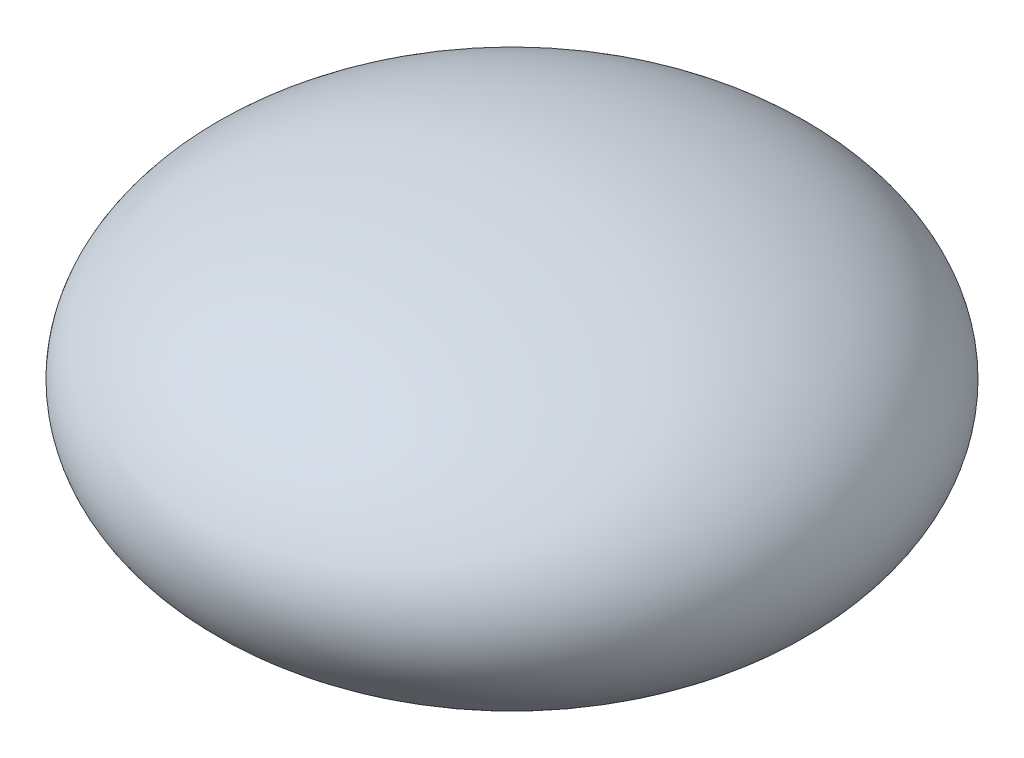
ISO-10303-21;
HEADER;
FILE_DESCRIPTION(('STEP AP214'),'2;1');
FILE_NAME('part.step','',(''),(''),'','','');
FILE_SCHEMA(('AUTOMOTIVE_DESIGN { 1 0 10303 214 1 1 1 1 }'));
ENDSEC;
DATA;
#1=APPLICATION_CONTEXT('core data for automotive mechanical design processes');
#2=APPLICATION_PROTOCOL_DEFINITION('international standard','automotive_design',2000,#1);
#3=PRODUCT_CONTEXT('',#1,'mechanical');
#4=PRODUCT('Part','Part','',(#3));
#5=PRODUCT_RELATED_PRODUCT_CATEGORY('part','',(#4));
#6=PRODUCT_DEFINITION_FORMATION('','',#4);
#7=PRODUCT_DEFINITION_CONTEXT('part definition',#1,'design');
#8=PRODUCT_DEFINITION('design','',#6,#7);
#9=PRODUCT_DEFINITION_SHAPE('','',#8);
#10=(LENGTH_UNIT() NAMED_UNIT(*) SI_UNIT(.MILLI.,.METRE.));
#11=(NAMED_UNIT(*) PLANE_ANGLE_UNIT() SI_UNIT($,.RADIAN.));
#12=(NAMED_UNIT(*) SI_UNIT($,.STERADIAN.) SOLID_ANGLE_UNIT());
#13=UNCERTAINTY_MEASURE_WITH_UNIT(LENGTH_MEASURE(1.E-05),#10,'distance_accuracy_value','');
#14=(GEOMETRIC_REPRESENTATION_CONTEXT(3) GLOBAL_UNCERTAINTY_ASSIGNED_CONTEXT((#13)) GLOBAL_UNIT_ASSIGNED_CONTEXT((#10,
#11,#12)) REPRESENTATION_CONTEXT('',''));
#15=CARTESIAN_POINT('',(0.,0.,0.));
#16=DIRECTION('',(0.,0.,1.));
#17=DIRECTION('',(1.,0.,0.));
#18=AXIS2_PLACEMENT_3D('',#15,#16,#17);
#19=CARTESIAN_POINT('',(0.,0.,0.));
#20=DIRECTION('',(0.,0.,1.));
#21=DIRECTION('',(1.,0.,0.));
#22=AXIS2_PLACEMENT_3D('',#19,#20,#21);
#23=ELLIPSE('',#22,10.75,5.5);
#24=TRIMMED_CURVE('',#23,(PARAMETER_VALUE(4.71238898038469)),
(PARAMETER_VALUE(7.85398163397448)),.T.,.PARAMETER.);
#25=CARTESIAN_POINT('',(0.,5.5,0.));
#26=DIRECTION('',(0.,1.,0.));
#27=AXIS1_PLACEMENT('',#25,#26);
#28=SURFACE_OF_REVOLUTION('',#24,#27);
#29=CARTESIAN_POINT('',(0.,5.5,0.));
#30=VERTEX_POINT('',#29);
#31=VERTEX_LOOP('',#30);
#32=FACE_BOUND('',#31,.T.);
#33=CARTESIAN_POINT('',(0.,-5.5,0.));
#34=VERTEX_POINT('',#33);
#35=VERTEX_LOOP('',#34);
#36=FACE_BOUND('',#35,.T.);
#37=ADVANCED_FACE('F36',(#32,#36),#28,.T.);
#38=CLOSED_SHELL('',(#37));
#39=MANIFOLD_SOLID_BREP('B2',#38);
#40=ADVANCED_BREP_SHAPE_REPRESENTATION('',(#18,#39),#14);
#41=SHAPE_DEFINITION_REPRESENTATION(#9,#40);
ENDSEC;
END-ISO-10303-21;
